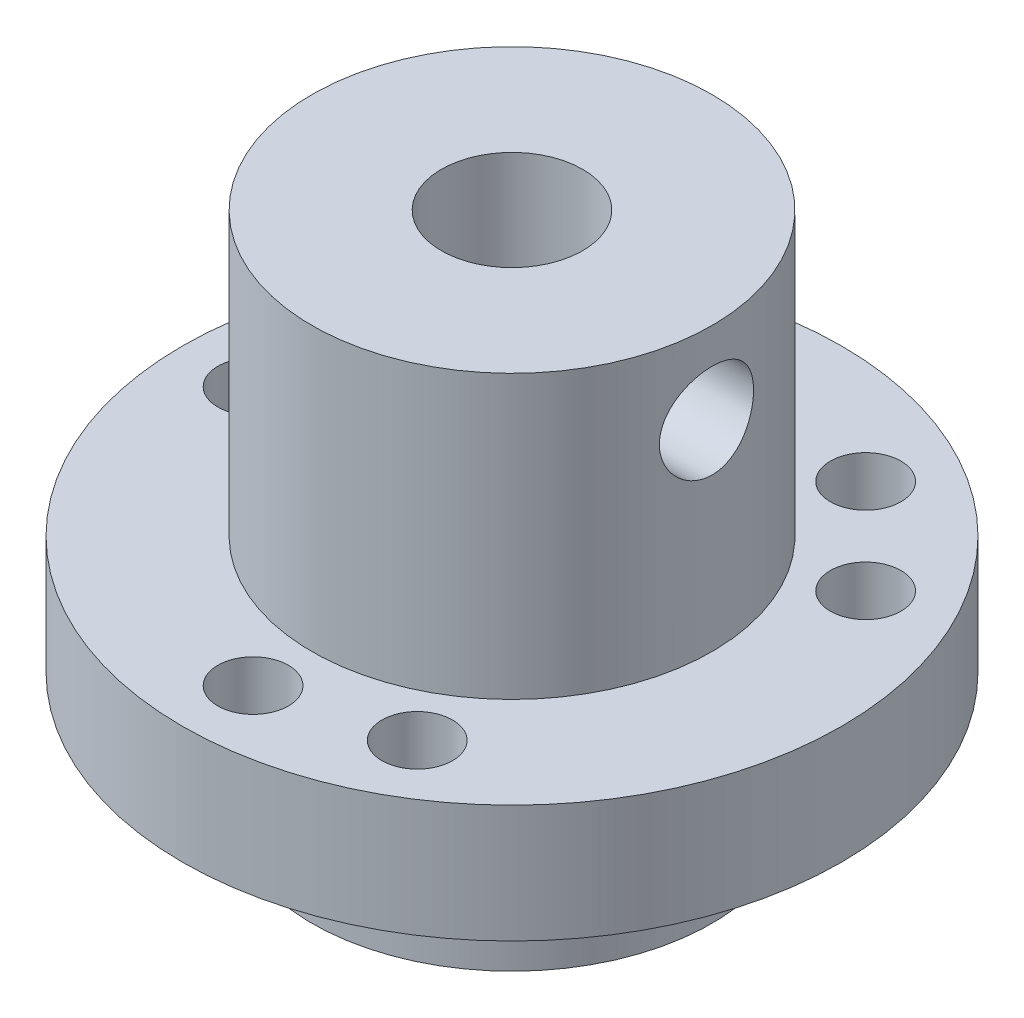
ISO-10303-21;
HEADER;
FILE_DESCRIPTION(('STEP AP214'),'2;1');
FILE_NAME('part.step','',(''),(''),'','','');
FILE_SCHEMA(('AUTOMOTIVE_DESIGN { 1 0 10303 214 1 1 1 1 }'));
ENDSEC;
DATA;
#1=APPLICATION_CONTEXT('core data for automotive mechanical design processes');
#2=APPLICATION_PROTOCOL_DEFINITION('international standard','automotive_design',2000,#1);
#3=PRODUCT_CONTEXT('',#1,'mechanical');
#4=PRODUCT('Part','Part','',(#3));
#5=PRODUCT_RELATED_PRODUCT_CATEGORY('part','',(#4));
#6=PRODUCT_DEFINITION_FORMATION('','',#4);
#7=PRODUCT_DEFINITION_CONTEXT('part definition',#1,'design');
#8=PRODUCT_DEFINITION('design','',#6,#7);
#9=PRODUCT_DEFINITION_SHAPE('','',#8);
#10=(LENGTH_UNIT() NAMED_UNIT(*) SI_UNIT(.MILLI.,.METRE.));
#11=(NAMED_UNIT(*) PLANE_ANGLE_UNIT() SI_UNIT($,.RADIAN.));
#12=(NAMED_UNIT(*) SI_UNIT($,.STERADIAN.) SOLID_ANGLE_UNIT());
#13=UNCERTAINTY_MEASURE_WITH_UNIT(LENGTH_MEASURE(1.E-05),#10,'distance_accuracy_value','');
#14=(GEOMETRIC_REPRESENTATION_CONTEXT(3) GLOBAL_UNCERTAINTY_ASSIGNED_CONTEXT((#13)) GLOBAL_UNIT_ASSIGNED_CONTEXT((#10,
#11,#12)) REPRESENTATION_CONTEXT('',''));
#15=CARTESIAN_POINT('',(0.,0.,0.));
#16=DIRECTION('',(0.,0.,1.));
#17=DIRECTION('',(1.,0.,0.));
#18=AXIS2_PLACEMENT_3D('',#15,#16,#17);
#19=CARTESIAN_POINT('',(-14.168,0.,-14.168));
#20=DIRECTION('',(0.,1.,0.));
#21=DIRECTION('',(0.,0.,1.));
#22=AXIS2_PLACEMENT_3D('',#19,#20,#21);
#23=PLANE('',#22);
#24=CARTESIAN_POINT('',(0.,0.,0.));
#25=DIRECTION('',(0.,1.,0.));
#26=DIRECTION('',(-1.,0.,0.));
#27=AXIS2_PLACEMENT_3D('',#24,#25,#26);
#28=CIRCLE('',#27,8.5);
#29=CARTESIAN_POINT('',(-8.5,0.,0.));
#30=VERTEX_POINT('',#29);
#31=EDGE_CURVE('E232',#30,#30,#28,.T.);
#32=ORIENTED_EDGE('',*,*,#31,.T.);
#33=EDGE_LOOP('',(#32));
#34=FACE_BOUND('',#33,.T.);
#35=CARTESIAN_POINT('',(0.,0.,11.));
#36=DIRECTION('',(0.,-1.,0.));
#37=DIRECTION('',(1.,0.,0.));
#38=AXIS2_PLACEMENT_3D('',#35,#36,#37);
#39=CIRCLE('',#38,1.5);
#40=CARTESIAN_POINT('',(1.5,0.,11.));
#41=VERTEX_POINT('',#40);
#42=EDGE_CURVE('E235',#41,#41,#39,.T.);
#43=ORIENTED_EDGE('',*,*,#42,.F.);
#44=EDGE_LOOP('',(#43));
#45=FACE_BOUND('',#44,.T.);
#46=CARTESIAN_POINT('',(-11.,0.,0.));
#47=DIRECTION('',(0.,-1.,0.));
#48=DIRECTION('',(1.,0.,0.));
#49=AXIS2_PLACEMENT_3D('',#46,#47,#48);
#50=CIRCLE('',#49,1.5);
#51=CARTESIAN_POINT('',(-9.5,0.,0.));
#52=VERTEX_POINT('',#51);
#53=EDGE_CURVE('E238',#52,#52,#50,.T.);
#54=ORIENTED_EDGE('',*,*,#53,.F.);
#55=EDGE_LOOP('',(#54));
#56=FACE_BOUND('',#55,.T.);
#57=CARTESIAN_POINT('',(5.5,0.,9.526279442));
#58=DIRECTION('',(0.,-1.,0.));
#59=DIRECTION('',(1.,0.,0.));
#60=AXIS2_PLACEMENT_3D('',#57,#58,#59);
#61=CIRCLE('',#60,1.5);
#62=CARTESIAN_POINT('',(7.,0.,9.526279442));
#63=VERTEX_POINT('',#62);
#64=EDGE_CURVE('E241',#63,#63,#61,.T.);
#65=ORIENTED_EDGE('',*,*,#64,.F.);
#66=EDGE_LOOP('',(#65));
#67=FACE_BOUND('',#66,.T.);
#68=CARTESIAN_POINT('',(9.526279442,0.,-5.5));
#69=DIRECTION('',(0.,-1.,0.));
#70=DIRECTION('',(1.,0.,0.));
#71=AXIS2_PLACEMENT_3D('',#68,#69,#70);
#72=CIRCLE('',#71,1.5);
#73=CARTESIAN_POINT('',(11.026279442,0.,-5.5));
#74=VERTEX_POINT('',#73);
#75=EDGE_CURVE('E244',#74,#74,#72,.T.);
#76=ORIENTED_EDGE('',*,*,#75,.F.);
#77=EDGE_LOOP('',(#76));
#78=FACE_BOUND('',#77,.T.);
#79=CARTESIAN_POINT('',(-9.526279442,0.,-5.5));
#80=DIRECTION('',(0.,-1.,0.));
#81=DIRECTION('',(1.,0.,0.));
#82=AXIS2_PLACEMENT_3D('',#79,#80,#81);
#83=CIRCLE('',#82,1.5);
#84=CARTESIAN_POINT('',(-8.026279442,0.,-5.5));
#85=VERTEX_POINT('',#84);
#86=EDGE_CURVE('E247',#85,#85,#83,.T.);
#87=ORIENTED_EDGE('',*,*,#86,.F.);
#88=EDGE_LOOP('',(#87));
#89=FACE_BOUND('',#88,.T.);
#90=CARTESIAN_POINT('',(5.5,0.,-9.526279442));
#91=DIRECTION('',(0.,-1.,0.));
#92=DIRECTION('',(1.,0.,0.));
#93=AXIS2_PLACEMENT_3D('',#90,#91,#92);
#94=CIRCLE('',#93,1.5);
#95=CARTESIAN_POINT('',(7.,0.,-9.526279442));
#96=VERTEX_POINT('',#95);
#97=EDGE_CURVE('E249',#96,#96,#94,.T.);
#98=ORIENTED_EDGE('',*,*,#97,.F.);
#99=EDGE_LOOP('',(#98));
#100=FACE_BOUND('',#99,.T.);
#101=CARTESIAN_POINT('',(0.,0.,0.));
#102=DIRECTION('',(0.,-1.,0.));
#103=DIRECTION('',(1.,0.,0.));
#104=AXIS2_PLACEMENT_3D('',#101,#102,#103);
#105=CIRCLE('',#104,14.);
#106=CARTESIAN_POINT('',(14.,0.,0.));
#107=VERTEX_POINT('',#106);
#108=EDGE_CURVE('E19',#107,#107,#105,.T.);
#109=ORIENTED_EDGE('',*,*,#108,.T.);
#110=EDGE_LOOP('',(#109));
#111=FACE_BOUND('',#110,.T.);
#112=ADVANCED_FACE('F15',(#34,#45,#56,#67,#78,#89,#100,#111),#23,.F.);
#113=CARTESIAN_POINT('',(0.,5.,0.));
#114=DIRECTION('',(0.,-1.,0.));
#115=DIRECTION('',(1.,0.,0.));
#116=AXIS2_PLACEMENT_3D('',#113,#114,#115);
#117=CYLINDRICAL_SURFACE('',#116,14.);
#118=ORIENTED_EDGE('',*,*,#108,.F.);
#119=EDGE_LOOP('',(#118));
#120=FACE_BOUND('',#119,.T.);
#121=CARTESIAN_POINT('',(0.,5.,0.));
#122=DIRECTION('',(0.,-1.,0.));
#123=DIRECTION('',(1.,0.,0.));
#124=AXIS2_PLACEMENT_3D('',#121,#122,#123);
#125=CIRCLE('',#124,14.);
#126=CARTESIAN_POINT('',(14.,5.,0.));
#127=VERTEX_POINT('',#126);
#128=EDGE_CURVE('E229',#127,#127,#125,.F.);
#129=ORIENTED_EDGE('',*,*,#128,.F.);
#130=EDGE_LOOP('',(#129));
#131=FACE_BOUND('',#130,.T.);
#132=ADVANCED_FACE('F77',(#120,#131),#117,.T.);
#133=CARTESIAN_POINT('',(5.5,5.,-9.526279442));
#134=DIRECTION('',(0.,-1.,0.));
#135=DIRECTION('',(1.,0.,0.));
#136=AXIS2_PLACEMENT_3D('',#133,#134,#135);
#137=CYLINDRICAL_SURFACE('',#136,1.5);
#138=ORIENTED_EDGE('',*,*,#97,.T.);
#139=EDGE_LOOP('',(#138));
#140=FACE_BOUND('',#139,.T.);
#141=CARTESIAN_POINT('',(5.5,5.,-9.526279442));
#142=DIRECTION('',(0.,-1.,0.));
#143=DIRECTION('',(1.,0.,0.));
#144=AXIS2_PLACEMENT_3D('',#141,#142,#143);
#145=CIRCLE('',#144,1.5);
#146=CARTESIAN_POINT('',(7.,5.,-9.526279442));
#147=VERTEX_POINT('',#146);
#148=EDGE_CURVE('E226',#147,#147,#145,.T.);
#149=ORIENTED_EDGE('',*,*,#148,.F.);
#150=EDGE_LOOP('',(#149));
#151=FACE_BOUND('',#150,.T.);
#152=ADVANCED_FACE('F73',(#140,#151),#137,.F.);
#153=CARTESIAN_POINT('',(-9.526279442,5.,-5.5));
#154=DIRECTION('',(0.,-1.,0.));
#155=DIRECTION('',(1.,0.,0.));
#156=AXIS2_PLACEMENT_3D('',#153,#154,#155);
#157=CYLINDRICAL_SURFACE('',#156,1.5);
#158=ORIENTED_EDGE('',*,*,#86,.T.);
#159=EDGE_LOOP('',(#158));
#160=FACE_BOUND('',#159,.T.);
#161=CARTESIAN_POINT('',(-9.526279442,5.,-5.5));
#162=DIRECTION('',(0.,-1.,0.));
#163=DIRECTION('',(1.,0.,0.));
#164=AXIS2_PLACEMENT_3D('',#161,#162,#163);
#165=CIRCLE('',#164,1.5);
#166=CARTESIAN_POINT('',(-8.026279442,5.,-5.5));
#167=VERTEX_POINT('',#166);
#168=EDGE_CURVE('E223',#167,#167,#165,.T.);
#169=ORIENTED_EDGE('',*,*,#168,.F.);
#170=EDGE_LOOP('',(#169));
#171=FACE_BOUND('',#170,.T.);
#172=ADVANCED_FACE('F69',(#160,#171),#157,.F.);
#173=CARTESIAN_POINT('',(9.526279442,5.,-5.5));
#174=DIRECTION('',(0.,-1.,0.));
#175=DIRECTION('',(1.,0.,0.));
#176=AXIS2_PLACEMENT_3D('',#173,#174,#175);
#177=CYLINDRICAL_SURFACE('',#176,1.5);
#178=ORIENTED_EDGE('',*,*,#75,.T.);
#179=EDGE_LOOP('',(#178));
#180=FACE_BOUND('',#179,.T.);
#181=CARTESIAN_POINT('',(9.526279442,5.,-5.5));
#182=DIRECTION('',(0.,-1.,0.));
#183=DIRECTION('',(1.,0.,0.));
#184=AXIS2_PLACEMENT_3D('',#181,#182,#183);
#185=CIRCLE('',#184,1.5);
#186=CARTESIAN_POINT('',(11.026279442,5.,-5.5));
#187=VERTEX_POINT('',#186);
#188=EDGE_CURVE('E220',#187,#187,#185,.T.);
#189=ORIENTED_EDGE('',*,*,#188,.F.);
#190=EDGE_LOOP('',(#189));
#191=FACE_BOUND('',#190,.T.);
#192=ADVANCED_FACE('F65',(#180,#191),#177,.F.);
#193=CARTESIAN_POINT('',(5.5,5.,9.526279442));
#194=DIRECTION('',(0.,-1.,0.));
#195=DIRECTION('',(1.,0.,0.));
#196=AXIS2_PLACEMENT_3D('',#193,#194,#195);
#197=CYLINDRICAL_SURFACE('',#196,1.5);
#198=ORIENTED_EDGE('',*,*,#64,.T.);
#199=EDGE_LOOP('',(#198));
#200=FACE_BOUND('',#199,.T.);
#201=CARTESIAN_POINT('',(5.5,5.,9.526279442));
#202=DIRECTION('',(0.,-1.,0.));
#203=DIRECTION('',(1.,0.,0.));
#204=AXIS2_PLACEMENT_3D('',#201,#202,#203);
#205=CIRCLE('',#204,1.5);
#206=CARTESIAN_POINT('',(7.,5.,9.526279442));
#207=VERTEX_POINT('',#206);
#208=EDGE_CURVE('E217',#207,#207,#205,.T.);
#209=ORIENTED_EDGE('',*,*,#208,.F.);
#210=EDGE_LOOP('',(#209));
#211=FACE_BOUND('',#210,.T.);
#212=ADVANCED_FACE('F61',(#200,#211),#197,.F.);
#213=CARTESIAN_POINT('',(-11.,5.,0.));
#214=DIRECTION('',(0.,-1.,0.));
#215=DIRECTION('',(1.,0.,0.));
#216=AXIS2_PLACEMENT_3D('',#213,#214,#215);
#217=CYLINDRICAL_SURFACE('',#216,1.5);
#218=ORIENTED_EDGE('',*,*,#53,.T.);
#219=EDGE_LOOP('',(#218));
#220=FACE_BOUND('',#219,.T.);
#221=CARTESIAN_POINT('',(-11.,5.,0.));
#222=DIRECTION('',(0.,-1.,0.));
#223=DIRECTION('',(1.,0.,0.));
#224=AXIS2_PLACEMENT_3D('',#221,#222,#223);
#225=CIRCLE('',#224,1.5);
#226=CARTESIAN_POINT('',(-9.5,5.,0.));
#227=VERTEX_POINT('',#226);
#228=EDGE_CURVE('E214',#227,#227,#225,.T.);
#229=ORIENTED_EDGE('',*,*,#228,.F.);
#230=EDGE_LOOP('',(#229));
#231=FACE_BOUND('',#230,.T.);
#232=ADVANCED_FACE('F57',(#220,#231),#217,.F.);
#233=CARTESIAN_POINT('',(0.,5.,11.));
#234=DIRECTION('',(0.,-1.,0.));
#235=DIRECTION('',(1.,0.,0.));
#236=AXIS2_PLACEMENT_3D('',#233,#234,#235);
#237=CYLINDRICAL_SURFACE('',#236,1.5);
#238=ORIENTED_EDGE('',*,*,#42,.T.);
#239=EDGE_LOOP('',(#238));
#240=FACE_BOUND('',#239,.T.);
#241=CARTESIAN_POINT('',(0.,5.,11.));
#242=DIRECTION('',(0.,-1.,0.));
#243=DIRECTION('',(1.,0.,0.));
#244=AXIS2_PLACEMENT_3D('',#241,#242,#243);
#245=CIRCLE('',#244,1.5);
#246=CARTESIAN_POINT('',(1.5,5.,11.));
#247=VERTEX_POINT('',#246);
#248=EDGE_CURVE('E211',#247,#247,#245,.T.);
#249=ORIENTED_EDGE('',*,*,#248,.F.);
#250=EDGE_LOOP('',(#249));
#251=FACE_BOUND('',#250,.T.);
#252=ADVANCED_FACE('F53',(#240,#251),#237,.F.);
#253=CARTESIAN_POINT('',(0.,-5.,0.));
#254=DIRECTION('',(0.,1.,0.));
#255=DIRECTION('',(-1.,0.,0.));
#256=AXIS2_PLACEMENT_3D('',#253,#254,#255);
#257=CYLINDRICAL_SURFACE('',#256,8.5);
#258=ORIENTED_EDGE('',*,*,#31,.F.);
#259=EDGE_LOOP('',(#258));
#260=FACE_BOUND('',#259,.T.);
#261=CARTESIAN_POINT('',(0.,-5.,0.));
#262=DIRECTION('',(0.,1.,0.));
#263=DIRECTION('',(-1.,0.,0.));
#264=AXIS2_PLACEMENT_3D('',#261,#262,#263);
#265=CIRCLE('',#264,8.5);
#266=CARTESIAN_POINT('',(-8.5,-5.,0.));
#267=VERTEX_POINT('',#266);
#268=EDGE_CURVE('E206',#267,#267,#265,.F.);
#269=ORIENTED_EDGE('',*,*,#268,.F.);
#270=EDGE_LOOP('',(#269));
#271=FACE_BOUND('',#270,.T.);
#272=ADVANCED_FACE('F49',(#260,#271),#257,.T.);
#273=CARTESIAN_POINT('',(-14.168,5.,-14.168));
#274=DIRECTION('',(0.,1.,0.));
#275=DIRECTION('',(0.,0.,1.));
#276=AXIS2_PLACEMENT_3D('',#273,#274,#275);
#277=PLANE('',#276);
#278=CARTESIAN_POINT('',(0.,5.,0.));
#279=DIRECTION('',(0.,-1.,0.));
#280=DIRECTION('',(0.,0.,-1.));
#281=AXIS2_PLACEMENT_3D('',#278,#279,#280);
#282=CIRCLE('',#281,8.5);
#283=CARTESIAN_POINT('',(0.,5.,-8.5));
#284=VERTEX_POINT('',#283);
#285=EDGE_CURVE('E202',#284,#284,#282,.T.);
#286=ORIENTED_EDGE('',*,*,#285,.T.);
#287=EDGE_LOOP('',(#286));
#288=FACE_BOUND('',#287,.T.);
#289=ORIENTED_EDGE('',*,*,#248,.T.);
#290=EDGE_LOOP('',(#289));
#291=FACE_BOUND('',#290,.T.);
#292=ORIENTED_EDGE('',*,*,#228,.T.);
#293=EDGE_LOOP('',(#292));
#294=FACE_BOUND('',#293,.T.);
#295=ORIENTED_EDGE('',*,*,#208,.T.);
#296=EDGE_LOOP('',(#295));
#297=FACE_BOUND('',#296,.T.);
#298=ORIENTED_EDGE('',*,*,#188,.T.);
#299=EDGE_LOOP('',(#298));
#300=FACE_BOUND('',#299,.T.);
#301=ORIENTED_EDGE('',*,*,#168,.T.);
#302=EDGE_LOOP('',(#301));
#303=FACE_BOUND('',#302,.T.);
#304=ORIENTED_EDGE('',*,*,#148,.T.);
#305=EDGE_LOOP('',(#304));
#306=FACE_BOUND('',#305,.T.);
#307=ORIENTED_EDGE('',*,*,#128,.T.);
#308=EDGE_LOOP('',(#307));
#309=FACE_BOUND('',#308,.T.);
#310=ADVANCED_FACE('F52',(#288,#291,#294,#297,#300,#303,#306,#309),#277,.T.);
#311=CARTESIAN_POINT('',(-8.602,17.,-8.602));
#312=DIRECTION('',(0.,1.,0.));
#313=DIRECTION('',(0.,0.,1.));
#314=AXIS2_PLACEMENT_3D('',#311,#312,#313);
#315=PLANE('',#314);
#316=CARTESIAN_POINT('',(0.,17.,0.));
#317=DIRECTION('',(0.,-1.,0.));
#318=DIRECTION('',(0.,0.,-1.));
#319=AXIS2_PLACEMENT_3D('',#316,#317,#318);
#320=CIRCLE('',#319,3.);
#321=CARTESIAN_POINT('',(0.,17.,-3.));
#322=VERTEX_POINT('',#321);
#323=EDGE_CURVE('E197',#322,#322,#320,.F.);
#324=ORIENTED_EDGE('',*,*,#323,.F.);
#325=EDGE_LOOP('',(#324));
#326=FACE_BOUND('',#325,.T.);
#327=CARTESIAN_POINT('',(0.,17.,0.));
#328=DIRECTION('',(0.,-1.,0.));
#329=DIRECTION('',(0.,0.,-1.));
#330=AXIS2_PLACEMENT_3D('',#327,#328,#329);
#331=CIRCLE('',#330,8.5);
#332=CARTESIAN_POINT('',(0.,17.,-8.5));
#333=VERTEX_POINT('',#332);
#334=EDGE_CURVE('E200',#333,#333,#331,.F.);
#335=ORIENTED_EDGE('',*,*,#334,.T.);
#336=EDGE_LOOP('',(#335));
#337=FACE_BOUND('',#336,.T.);
#338=ADVANCED_FACE('F86',(#326,#337),#315,.T.);
#339=CARTESIAN_POINT('',(-8.602,-5.,8.602));
#340=DIRECTION('',(0.,-1.,0.));
#341=DIRECTION('',(0.,0.,-1.));
#342=AXIS2_PLACEMENT_3D('',#339,#340,#341);
#343=PLANE('',#342);
#344=CARTESIAN_POINT('',(0.,-5.,0.));
#345=DIRECTION('',(0.,-1.,0.));
#346=DIRECTION('',(0.,0.,-1.));
#347=AXIS2_PLACEMENT_3D('',#344,#345,#346);
#348=CIRCLE('',#347,3.);
#349=CARTESIAN_POINT('',(0.,-5.,-3.));
#350=VERTEX_POINT('',#349);
#351=EDGE_CURVE('E28',#350,#350,#348,.T.);
#352=ORIENTED_EDGE('',*,*,#351,.F.);
#353=EDGE_LOOP('',(#352));
#354=FACE_BOUND('',#353,.T.);
#355=ORIENTED_EDGE('',*,*,#268,.T.);
#356=EDGE_LOOP('',(#355));
#357=FACE_BOUND('',#356,.T.);
#358=ADVANCED_FACE('F17',(#354,#357),#343,.T.);
#359=CARTESIAN_POINT('',(0.,17.,0.));
#360=DIRECTION('',(0.,-1.,0.));
#361=DIRECTION('',(0.,0.,-1.));
#362=AXIS2_PLACEMENT_3D('',#359,#360,#361);
#363=CYLINDRICAL_SURFACE('',#362,8.5);
#364=ORIENTED_EDGE('',*,*,#285,.F.);
#365=EDGE_LOOP('',(#364));
#366=FACE_BOUND('',#365,.T.);
#367=ORIENTED_EDGE('',*,*,#334,.F.);
#368=EDGE_LOOP('',(#367));
#369=FACE_BOUND('',#368,.T.);
#370=CARTESIAN_POINT('',(8.26135582076439,13.4999999997845,1.99999999979059));
#371=CARTESIAN_POINT('',(8.26135921338681,13.3894647574074,1.99999441544813));
#372=CARTESIAN_POINT('',(8.26360086436327,13.2787968642197,1.99079590111176));
#373=CARTESIAN_POINT('',(8.27231429815348,13.0605288986297,1.95426552795603));
#374=CARTESIAN_POINT('',(8.27879421571922,12.9529351419216,1.92689879629933));
#375=CARTESIAN_POINT('',(8.29520942669297,12.7441463034427,1.85495303782906));
#376=CARTESIAN_POINT('',(8.30513887269703,12.6429407337614,1.81040312476464));
#377=CARTESIAN_POINT('',(8.32732675931643,12.4494657586712,1.70543063231355));
#378=CARTESIAN_POINT('',(8.33958456360375,12.357193922098,1.64501238793554));
#379=CARTESIAN_POINT('',(8.3653192122399,12.1823563537744,1.50874582567502));
#380=CARTESIAN_POINT('',(8.37881378005953,12.0999911084021,1.43264354888235));
#381=CARTESIAN_POINT('',(8.40534760565707,11.9490643954344,1.26771320182634));
#382=CARTESIAN_POINT('',(8.41838679953726,11.8805048586642,1.17888335449222));
#383=CARTESIAN_POINT('',(8.44273296564638,11.7583404974551,0.989674059595087));
#384=CARTESIAN_POINT('',(8.45401677551557,11.7049290425466,0.889166523651568));
#385=CARTESIAN_POINT('',(8.47338113450362,11.615831905898,0.680291982571322));
#386=CARTESIAN_POINT('',(8.48146212641767,11.5801437737047,0.571926066321723));
#387=CARTESIAN_POINT('',(8.49338602872008,11.5281381030018,0.35248415784322));
#388=CARTESIAN_POINT('',(8.4973027386492,11.5114828504966,0.241492279294365));
#389=CARTESIAN_POINT('',(8.50071322914709,11.4969576998085,0.0182251834082839));
#390=CARTESIAN_POINT('',(8.50020758577637,11.4990853549443,-0.0940498648790921));
#391=CARTESIAN_POINT('',(8.49488599848874,11.5218184893093,-0.314359844747423));
#392=CARTESIAN_POINT('',(8.49015506392365,11.5420595574961,-0.422434737974194));
#393=CARTESIAN_POINT('',(8.47701234751188,11.599861909613,-0.633609784897385));
#394=CARTESIAN_POINT('',(8.46860035819201,11.6374241698142,-0.736709657825865));
#395=CARTESIAN_POINT('',(8.44890712377334,11.7291120009304,-0.935995170986698));
#396=CARTESIAN_POINT('',(8.43760275328055,11.7833718177529,-1.03211666770067));
#397=CARTESIAN_POINT('',(8.4133586014036,11.9068096720779,-1.21401365583701));
#398=CARTESIAN_POINT('',(8.40041867730677,11.9759890117782,-1.29978824314629));
#399=CARTESIAN_POINT('',(8.37395445304935,12.1292577099172,-1.46072081983792));
#400=CARTESIAN_POINT('',(8.3604235762208,12.2136633854148,-1.53557673191831));
#401=CARTESIAN_POINT('',(8.33458228557318,12.3940112377334,-1.67016488128216));
#402=CARTESIAN_POINT('',(8.32227241465879,12.4899585047925,-1.72989040921267));
#403=CARTESIAN_POINT('',(8.30024411488816,12.6912353094053,-1.83268511820618));
#404=CARTESIAN_POINT('',(8.29053797475809,12.796606313131,-1.87567573171597));
#405=CARTESIAN_POINT('',(8.27498302804681,13.013231367963,-1.94316097818596));
#406=CARTESIAN_POINT('',(8.26912610080722,13.1244724954312,-1.96769456574747));
#407=CARTESIAN_POINT('',(8.26415489134597,13.2805089901438,-1.98840807110972));
#408=CARTESIAN_POINT('',(8.26310792788273,13.3242815686093,-1.99275097413401));
#409=CARTESIAN_POINT('',(8.26170771648068,13.4120290923017,-1.99854805405855));
#410=CARTESIAN_POINT('',(8.26135447053955,13.4560040381111,-2.0000022226402));
#411=CARTESIAN_POINT('',(8.26135921364155,13.6105352415115,-1.99999441584938));
#412=CARTESIAN_POINT('',(8.26360086440629,13.7212031346958,-1.99079590132388));
#413=CARTESIAN_POINT('',(8.27231429802466,13.9394711003105,-1.95426552810284));
#414=CARTESIAN_POINT('',(8.2787942156313,14.0470648570464,-1.92689879656828));
#415=CARTESIAN_POINT('',(8.29520942662267,14.2558536955771,-1.85495303825331));
#416=CARTESIAN_POINT('',(8.30513887260323,14.357059265283,-1.81040312522379));
#417=CARTESIAN_POINT('',(8.32732675919663,14.550534240422,-1.70543063286489));
#418=CARTESIAN_POINT('',(8.33958456348124,14.6428060770205,-1.64501238854557));
#419=CARTESIAN_POINT('',(8.36531921211185,14.8176436454058,-1.50874582639236));
#420=CARTESIAN_POINT('',(8.37881377992865,14.9000088908145,-1.43264354964782));
#421=CARTESIAN_POINT('',(8.40534760552732,15.0509356038666,-1.26771320268083));
#422=CARTESIAN_POINT('',(8.41838679941144,15.1194951406841,-1.17888335538706));
#423=CARTESIAN_POINT('',(8.44273296553308,15.241659501997,-0.989674060559561));
#424=CARTESIAN_POINT('',(8.45401677541085,15.2950709569614,-0.889166524644845));
#425=CARTESIAN_POINT('',(8.47338113441958,15.3841680937255,-0.680291983613927));
#426=CARTESIAN_POINT('',(8.48146212634578,15.4198562259785,-0.571926067384967));
#427=CARTESIAN_POINT('',(8.49338602867478,15.4718618968037,-0.35248415893208));
#428=CARTESIAN_POINT('',(8.49730273861812,15.4885171493709,-0.241492280388206));
#429=CARTESIAN_POINT('',(8.50071322914476,15.5030423001818,-0.0182251845008716));
#430=CARTESIAN_POINT('',(8.50020758578853,15.5009146451071,0.0940498637927401));
#431=CARTESIAN_POINT('',(8.49488599852834,15.4781815108604,0.314359843679976));
#432=CARTESIAN_POINT('',(8.49015506397635,15.4579404427316,0.422434736919279));
#433=CARTESIAN_POINT('',(8.47701234758832,15.4001380907272,0.633609783877569));
#434=CARTESIAN_POINT('',(8.46860035827906,15.3625758305804,0.736709656828585));
#435=CARTESIAN_POINT('',(8.4489071238786,15.2708879995704,0.935995170038975));
#436=CARTESIAN_POINT('',(8.4376027533935,15.2166281828004,1.03211666678034));
#437=CARTESIAN_POINT('',(8.41335860152789,15.0931903285768,1.21401365497744));
#438=CARTESIAN_POINT('',(8.40041867743473,15.0240109889257,1.29978824232029));
#439=CARTESIAN_POINT('',(8.3739544531808,14.8707422908821,1.46072081908754));
#440=CARTESIAN_POINT('',(8.36042357635197,14.7863366154307,1.53557673121035));
#441=CARTESIAN_POINT('',(8.33458228569591,14.6059887631931,1.67016488066776));
#442=CARTESIAN_POINT('',(8.32227241477341,14.5100414961682,1.72989040864863));
#443=CARTESIAN_POINT('',(8.30024411498959,14.3087646916085,1.8326851177622));
#444=CARTESIAN_POINT('',(8.29053797485462,14.203393687901,1.87567573134062));
#445=CARTESIAN_POINT('',(8.27498302810098,13.9867686331025,1.94316097790767));
#446=CARTESIAN_POINT('',(8.26912610082369,13.8755275056502,1.96769456549912));
#447=CARTESIAN_POINT('',(8.26415489137644,13.7194910105953,1.98840807105231));
#448=CARTESIAN_POINT('',(8.26310792792293,13.6757184317728,1.99275097415151));
#449=CARTESIAN_POINT('',(8.26170771644114,13.5879709073576,1.99854805403831));
#450=CARTESIAN_POINT('',(8.26135447041059,13.5439959611824,2.00000222250716));
#451=CARTESIAN_POINT('',(8.26135582076439,13.4999999997845,1.99999999979059));
#452=B_SPLINE_CURVE_WITH_KNOTS('',3,(#370,#371,#372,#373,#374,#375,#376,#377,#378,#379,#380,
#381,#382,#383,#384,#385,#386,#387,#388,#389,#390,#391,#392,#393,#394,#395,#396,#397,#398,#399,
#400,#401,#402,#403,#404,#405,#406,#407,#408,#409,#410,#411,#412,#413,#414,#415,#416,#417,#418,
#419,#420,#421,#422,#423,#424,#425,#426,#427,#428,#429,#430,#431,#432,#433,#434,#435,#436,#437,
#438,#439,#440,#441,#442,#443,#444,#445,#446,#447,#448,#449,#450,#451),.UNSPECIFIED.,.T.,.F.,(4,
2,2,2,2,2,2,2,2,2,2,2,2,2,2,2,2,2,2,2,2,2,2,2,2,2,2,2,2,2,2,2,2,2,2,2,2,2,2,2,4),(0.,
0.331436895701064,0.663511811738219,0.995026541910078,1.32645080087373,1.66373566018775,
2.00106765844414,2.34252966359301,2.68394444454036,3.01920231393138,3.35441651292215,
3.68303471831624,4.01167144781686,4.34302262896764,4.67440274264889,5.0136880952936,
5.35312363686795,5.69413408513994,6.03442277664195,6.16634308047043,6.29826376418475,
6.62970065987671,6.9617755759467,7.29329030612049,7.62471456505684,7.9619994243503,
8.29933142259993,8.64079342775365,8.98220820870106,9.31746607810616,9.65268027711173,
9.98129848250891,10.3099352120146,10.6412863931572,10.9726665068232,11.3119518594484,
11.651387401021,11.9923978493139,12.33268654081,12.4646068457184,12.5965275305201),.UNSPECIFIED.);
#453=CARTESIAN_POINT('',(8.26135582076439,13.4999999997845,1.99999999979059));
#454=VERTEX_POINT('',#453);
#455=EDGE_CURVE('E23',#454,#454,#452,.T.);
#456=ORIENTED_EDGE('',*,*,#455,.F.);
#457=EDGE_LOOP('',(#456));
#458=FACE_BOUND('',#457,.T.);
#459=ADVANCED_FACE('F43',(#366,#369,#458),#363,.T.);
#460=CARTESIAN_POINT('',(0.,17.,0.));
#461=DIRECTION('',(0.,-1.,0.));
#462=DIRECTION('',(0.,0.,-1.));
#463=AXIS2_PLACEMENT_3D('',#460,#461,#462);
#464=CYLINDRICAL_SURFACE('',#463,3.);
#465=ORIENTED_EDGE('',*,*,#323,.T.);
#466=EDGE_LOOP('',(#465));
#467=FACE_BOUND('',#466,.T.);
#468=ORIENTED_EDGE('',*,*,#351,.T.);
#469=EDGE_LOOP('',(#468));
#470=FACE_BOUND('',#469,.T.);
#471=CARTESIAN_POINT('',(2.23606797758318,13.4999999991796,-2.00000000018646));
#472=CARTESIAN_POINT('',(2.23607898606409,13.4025479719616,-1.99999357257412));
#473=CARTESIAN_POINT('',(2.24256989101684,13.3048988277717,-1.99280193920787));
#474=CARTESIAN_POINT('',(2.26728883973193,13.1130131982308,-1.96461818382692));
#475=CARTESIAN_POINT('',(2.28555759543665,13.0187897523617,-1.94357818752772));
#476=CARTESIAN_POINT('',(2.33057003505685,12.8372545375845,-1.8893536070737));
#477=CARTESIAN_POINT('',(2.35722539189618,12.7498820826584,-1.85629506131604));
#478=CARTESIAN_POINT('',(2.41585264130182,12.5821029573349,-1.77932401797774));
#479=CARTESIAN_POINT('',(2.44782369648043,12.501695192812,-1.73541322943348));
#480=CARTESIAN_POINT('',(2.51945927967355,12.3363570546536,-1.63002623456239));
#481=CARTESIAN_POINT('',(2.55954634102067,12.2526743529919,-1.56687911529027));
#482=CARTESIAN_POINT('',(2.63944527389486,12.096002621679,-1.42819788390192));
#483=CARTESIAN_POINT('',(2.6792568109964,12.0230249513507,-1.35265079142569));
#484=CARTESIAN_POINT('',(2.76088842132801,11.8793559797646,-1.17815640180125));
#485=CARTESIAN_POINT('',(2.80216830093874,11.8105167638786,-1.07740535779851));
#486=CARTESIAN_POINT('',(2.87558518928516,11.6913573516301,-0.862469743198033));
#487=CARTESIAN_POINT('',(2.90773249928273,11.6410162709624,-0.748300515143669));
#488=CARTESIAN_POINT('',(2.95599908883202,11.5664435800693,-0.523249006027148));
#489=CARTESIAN_POINT('',(2.97351177824497,11.5399166227313,-0.413434585249238));
#490=CARTESIAN_POINT('',(2.996097461385,11.5058154999448,-0.189695303266328));
#491=CARTESIAN_POINT('',(3.00118613677413,11.498217442083,-0.0757758081049542));
#492=CARTESIAN_POINT('',(2.99855361865486,11.5021724477803,0.13414693194556));
#493=CARTESIAN_POINT('',(2.99266266372743,11.5109890288468,0.230240400729942));
#494=CARTESIAN_POINT('',(2.9720818641003,11.542090997021,0.419238403765326));
#495=CARTESIAN_POINT('',(2.95739135594801,11.5643773997028,0.512142697006226));
#496=CARTESIAN_POINT('',(2.92052093574812,11.6211956534101,0.692077845653347));
#497=CARTESIAN_POINT('',(2.8983708249599,11.6556788053112,0.779130444102195));
#498=CARTESIAN_POINT('',(2.8482111035509,11.7355535573121,0.946208984201717));
#499=CARTESIAN_POINT('',(2.82020041130251,11.7809471712747,1.02623362489795));
#500=CARTESIAN_POINT('',(2.75617979212166,11.8879800210635,1.18828629134322));
#501=CARTESIAN_POINT('',(2.71960237667331,11.9509703065863,1.26919524524257));
#502=CARTESIAN_POINT('',(2.64400421256638,12.0879022659212,1.41999132391182));
#503=CARTESIAN_POINT('',(2.60497985785161,12.1618603328126,1.48986162112715));
#504=CARTESIAN_POINT('',(2.52150866883119,12.3319457531775,1.62770872323927));
#505=CARTESIAN_POINT('',(2.47715942614288,12.4297324445451,1.69371158320483));
#506=CARTESIAN_POINT('',(2.3947704017166,12.6374715509318,1.80833064015458));
#507=CARTESIAN_POINT('',(2.35672237541258,12.7474077501505,1.8569696540509));
#508=CARTESIAN_POINT('',(2.30245807048323,12.9453328194189,1.92353610633127));
#509=CARTESIAN_POINT('',(2.28311192904112,13.0308525285117,1.94624908437146));
#510=CARTESIAN_POINT('',(2.25374530261538,13.2055546144942,1.9801903108212));
#511=CARTESIAN_POINT('',(2.24369169396826,13.2947227896037,1.99145936591657));
#512=CARTESIAN_POINT('',(2.2380603446115,13.4036167377247,1.99777001990669));
#513=CARTESIAN_POINT('',(2.23731496768082,13.422872993908,1.99860518726589));
#514=CARTESIAN_POINT('',(2.23631765352686,13.461416920982,1.9997208595124));
#515=CARTESIAN_POINT('',(2.23606579786981,13.4807045965384,2.00000127271334));
#516=CARTESIAN_POINT('',(2.23607898579952,13.5974520269793,1.99999357212225));
#517=CARTESIAN_POINT('',(2.24256989086443,13.6951011711483,1.99280193917764));
#518=CARTESIAN_POINT('',(2.26728883960011,13.8869868006455,1.96461818418177));
#519=CARTESIAN_POINT('',(2.28555759521122,13.9812102464922,1.94357818784598));
#520=CARTESIAN_POINT('',(2.33057003470773,14.1627454612424,1.88935360744796));
#521=CARTESIAN_POINT('',(2.35722539151673,14.2501179161636,1.856295061781));
#522=CARTESIAN_POINT('',(2.41585264086018,14.4178970414935,1.77932401859077));
#523=CARTESIAN_POINT('',(2.44782369600744,14.4983048060271,1.73541323010284));
#524=CARTESIAN_POINT('',(2.5194592791406,14.6636429441964,1.630026235377));
#525=CARTESIAN_POINT('',(2.55954634046089,14.7473256458614,1.56687911619848));
#526=CARTESIAN_POINT('',(2.63944527329473,14.9039973771931,1.42819788500715));
#527=CARTESIAN_POINT('',(2.67925681038277,14.9769750475373,1.35265079263495));
#528=CARTESIAN_POINT('',(2.76088842073224,15.1206440192236,1.17815640319183));
#529=CARTESIAN_POINT('',(2.80216830037503,15.1894832351887,1.07740535925934));
#530=CARTESIAN_POINT('',(2.87558518880741,15.3086426476122,0.862469744785404));
#531=CARTESIAN_POINT('',(2.90773249885857,15.3589837283755,0.748300516786953));
#532=CARTESIAN_POINT('',(2.95599908853559,15.4335564194787,0.523249007706277));
#533=CARTESIAN_POINT('',(2.97351177801605,15.4600833769219,0.413434586906871));
#534=CARTESIAN_POINT('',(2.99609746128574,15.4941844999066,0.189695304856945));
#535=CARTESIAN_POINT('',(3.00118613673719,15.5017825578616,0.0757758096501427));
#536=CARTESIAN_POINT('',(2.99855361872118,15.4978275523192,-0.134146930480035));
#537=CARTESIAN_POINT('',(2.9926626638388,15.4890109713205,-0.230240399295884));
#538=CARTESIAN_POINT('',(2.97208186429307,15.4579090032713,-0.419238402406206));
#539=CARTESIAN_POINT('',(2.95739135617707,15.4356226006467,-0.51214269569056));
#540=CARTESIAN_POINT('',(2.92052093604664,15.3788043470534,-0.692077844393862));
#541=CARTESIAN_POINT('',(2.89837082529472,15.3443211952141,-0.779130442857664));
#542=CARTESIAN_POINT('',(2.84821110395218,15.2644464433347,-0.946208982994536));
#543=CARTESIAN_POINT('',(2.82020041173403,15.219052829432,-1.02623362371327));
#544=CARTESIAN_POINT('',(2.75617979261601,15.1120199797798,-1.18828629019636));
#545=CARTESIAN_POINT('',(2.71960237720018,15.0490296943359,-1.26919524411403));
#546=CARTESIAN_POINT('',(2.64400421314515,14.9120977351593,-1.41999132283515));
#547=CARTESIAN_POINT('',(2.60497985844966,14.8381396683468,-1.48986162008367));
#548=CARTESIAN_POINT('',(2.52150866944465,14.6680542481413,-1.6277087222905));
#549=CARTESIAN_POINT('',(2.47715942674962,14.5702675568525,-1.69371158231696));
#550=CARTESIAN_POINT('',(2.39477040228473,14.362528450632,-1.80833063940802));
#551=CARTESIAN_POINT('',(2.3567223759484,14.2525922515015,-1.85696965338602));
#552=CARTESIAN_POINT('',(2.3024580709054,14.0546671823384,-1.92353610581897));
#553=CARTESIAN_POINT('',(2.28311192939837,13.9691474732625,-1.94624908392551));
#554=CARTESIAN_POINT('',(2.25374530285697,13.7944453872898,-1.98019031057511));
#555=CARTESIAN_POINT('',(2.24369169416003,13.7052772121729,-1.99145936580256));
#556=CARTESIAN_POINT('',(2.23806034465684,13.5963832635696,-1.99777001983415));
#557=CARTESIAN_POINT('',(2.23731496769029,13.5771270069216,-1.99860518720374));
#558=CARTESIAN_POINT('',(2.23631765353625,13.5385830789179,-1.99972085955345));
#559=CARTESIAN_POINT('',(2.23606579791499,13.5192954028965,-2.00000127284726));
#560=CARTESIAN_POINT('',(2.23606797758318,13.4999999991796,-2.00000000018646));
#561=B_SPLINE_CURVE_WITH_KNOTS('',3,(#471,#472,#473,#474,#475,#476,#477,#478,#479,#480,#481,
#482,#483,#484,#485,#486,#487,#488,#489,#490,#491,#492,#493,#494,#495,#496,#497,#498,#499,#500,
#501,#502,#503,#504,#505,#506,#507,#508,#509,#510,#511,#512,#513,#514,#515,#516,#517,#518,#519,
#520,#521,#522,#523,#524,#525,#526,#527,#528,#529,#530,#531,#532,#533,#534,#535,#536,#537,#538,
#539,#540,#541,#542,#543,#544,#545,#546,#547,#548,#549,#550,#551,#552,#553,#554,#555,#556,#557,
#558,#559,#560),.UNSPECIFIED.,.T.,.F.,(4,2,2,2,2,2,2,2,2,2,2,2,2,2,2,2,2,2,2,2,2,2,2,2,2,2,2,2,
2,2,2,2,2,2,2,2,2,2,2,2,2,2,2,2,4),(0.,0.292261730977803,0.585539165626953,0.875825762891014,
1.16606667424582,1.50153426230635,1.83735528593877,2.22167245890991,2.60555439674427,
2.9463751375478,3.28676546954033,3.57539509534455,3.86404648545627,4.15155812365561,
4.43912287182067,4.76448291233517,5.09033424974758,5.4667177140282,5.8426047562275,
6.11328694224163,6.38300050554721,6.44085847235203,6.49872600076718,6.79098773164994,
7.08426516617022,7.37455176331963,7.66479267458737,8.00026026247316,8.33608128591392,
8.72039845888008,9.1042803967206,9.44510113768863,9.78549146984082,10.0741210957108,
10.3627724858899,10.6502841240382,10.9378488721479,11.2632089125343,11.5890602498295,
11.965443714033,12.3413307561273,12.6120129421921,12.8817265055767,12.9395844737793,
12.9974520035907),.UNSPECIFIED.);
#562=CARTESIAN_POINT('',(2.23606797758318,13.4999999991796,-2.00000000018646));
#563=VERTEX_POINT('',#562);
#564=EDGE_CURVE('E10',#563,#563,#561,.T.);
#565=ORIENTED_EDGE('',*,*,#564,.F.);
#566=EDGE_LOOP('',(#565));
#567=FACE_BOUND('',#566,.T.);
#568=ADVANCED_FACE('F40',(#467,#470,#567),#464,.F.);
#569=CARTESIAN_POINT('',(8.53760130938006,13.5,0.));
#570=DIRECTION('',(-1.,0.,0.));
#571=DIRECTION('',(0.,-1.,0.));
#572=AXIS2_PLACEMENT_3D('',#569,#570,#571);
#573=CYLINDRICAL_SURFACE('',#572,2.);
#574=ORIENTED_EDGE('',*,*,#564,.T.);
#575=EDGE_LOOP('',(#574));
#576=FACE_BOUND('',#575,.T.);
#577=ORIENTED_EDGE('',*,*,#455,.T.);
#578=EDGE_LOOP('',(#577));
#579=FACE_BOUND('',#578,.T.);
#580=ADVANCED_FACE('F38',(#576,#579),#573,.F.);
#581=CLOSED_SHELL('',(#112,#132,#152,#172,#192,#212,#232,#252,#272,#310,#338,#358,#459,#568,#580));
#582=MANIFOLD_SOLID_BREP('B1',#581);
#583=ADVANCED_BREP_SHAPE_REPRESENTATION('',(#18,#582),#14);
#584=SHAPE_DEFINITION_REPRESENTATION(#9,#583);
ENDSEC;
END-ISO-10303-21;
